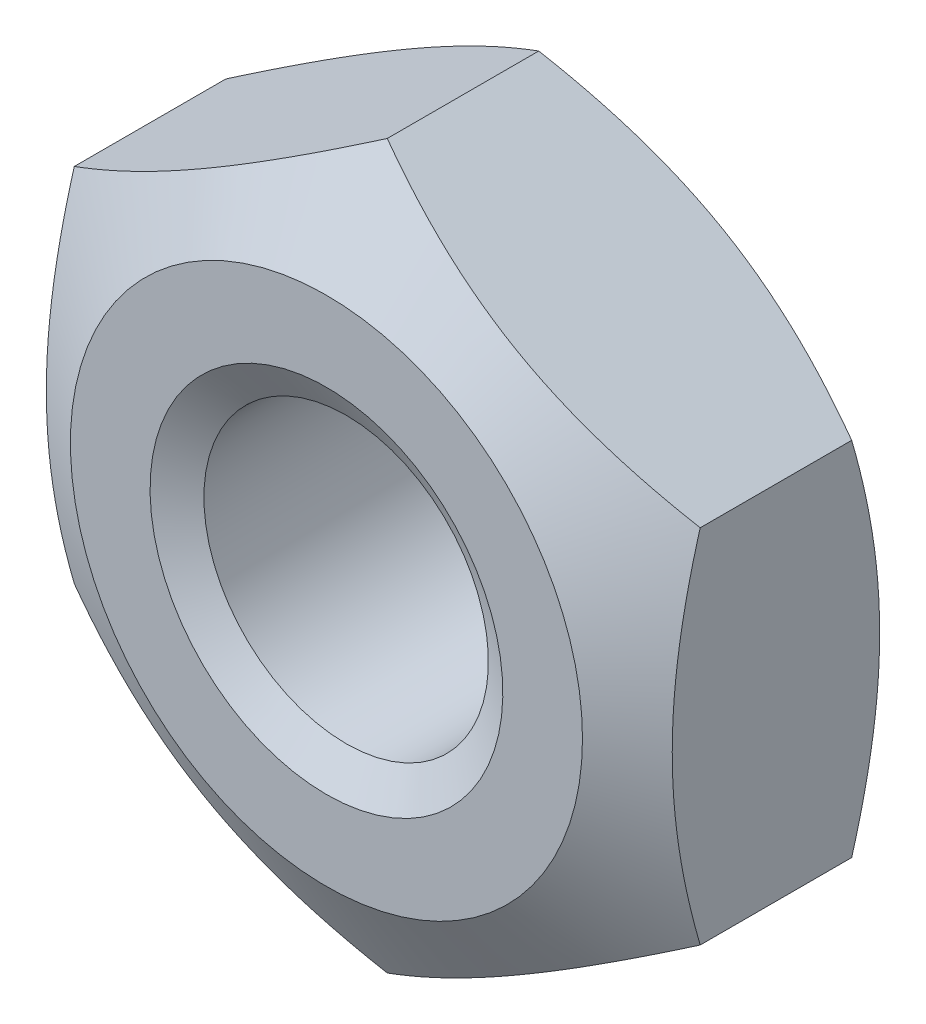
ISO-10303-21;
HEADER;
FILE_DESCRIPTION(('STEP AP214'),'2;1');
FILE_NAME('part.step','',(''),(''),'','','');
FILE_SCHEMA(('AUTOMOTIVE_DESIGN { 1 0 10303 214 1 1 1 1 }'));
ENDSEC;
DATA;
#1=APPLICATION_CONTEXT('core data for automotive mechanical design processes');
#2=APPLICATION_PROTOCOL_DEFINITION('international standard','automotive_design',2000,#1);
#3=PRODUCT_CONTEXT('',#1,'mechanical');
#4=PRODUCT('Part','Part','',(#3));
#5=PRODUCT_RELATED_PRODUCT_CATEGORY('part','',(#4));
#6=PRODUCT_DEFINITION_FORMATION('','',#4);
#7=PRODUCT_DEFINITION_CONTEXT('part definition',#1,'design');
#8=PRODUCT_DEFINITION('design','',#6,#7);
#9=PRODUCT_DEFINITION_SHAPE('','',#8);
#10=(LENGTH_UNIT() NAMED_UNIT(*) SI_UNIT(.MILLI.,.METRE.));
#11=(NAMED_UNIT(*) PLANE_ANGLE_UNIT() SI_UNIT($,.RADIAN.));
#12=(NAMED_UNIT(*) SI_UNIT($,.STERADIAN.) SOLID_ANGLE_UNIT());
#13=UNCERTAINTY_MEASURE_WITH_UNIT(LENGTH_MEASURE(1.E-05),#10,'distance_accuracy_value','');
#14=(GEOMETRIC_REPRESENTATION_CONTEXT(3) GLOBAL_UNCERTAINTY_ASSIGNED_CONTEXT((#13)) GLOBAL_UNIT_ASSIGNED_CONTEXT((#10,
#11,#12)) REPRESENTATION_CONTEXT('',''));
#15=CARTESIAN_POINT('',(0.,0.,0.));
#16=DIRECTION('',(0.,0.,1.));
#17=DIRECTION('',(1.,0.,0.));
#18=AXIS2_PLACEMENT_3D('',#15,#16,#17);
#19=CARTESIAN_POINT('',(0.,0.,0.));
#20=DIRECTION('',(0.,0.,1.));
#21=DIRECTION('',(1.,0.,0.));
#22=AXIS2_PLACEMENT_3D('',#19,#20,#21);
#23=PLANE('',#22);
#24=CARTESIAN_POINT('',(0.,0.,0.));
#25=DIRECTION('',(0.,0.,1.));
#26=DIRECTION('',(0.,-1.,0.));
#27=AXIS2_PLACEMENT_3D('',#24,#25,#26);
#28=CIRCLE('',#27,1.55);
#29=CARTESIAN_POINT('',(0.,-1.54999999999999,0.));
#30=VERTEX_POINT('',#29);
#31=EDGE_CURVE('E269',#30,#30,#28,.T.);
#32=ORIENTED_EDGE('',*,*,#31,.F.);
#33=EDGE_LOOP('',(#32));
#34=FACE_BOUND('',#33,.T.);
#35=CARTESIAN_POINT('',(0.,0.,0.));
#36=DIRECTION('',(0.,0.,1.));
#37=DIRECTION('',(1.,0.,0.));
#38=AXIS2_PLACEMENT_3D('',#35,#36,#37);
#39=CIRCLE('',#38,2.25);
#40=CARTESIAN_POINT('',(2.25,0.,0.));
#41=VERTEX_POINT('',#40);
#42=EDGE_CURVE('E228',#41,#41,#39,.T.);
#43=ORIENTED_EDGE('',*,*,#42,.T.);
#44=EDGE_LOOP('',(#43));
#45=FACE_BOUND('',#44,.T.);
#46=ADVANCED_FACE('F41',(#34,#45),#23,.T.);
#47=CARTESIAN_POINT('',(0.,0.,0.));
#48=DIRECTION('',(0.,0.,-1.));
#49=DIRECTION('',(-1.,0.,0.));
#50=AXIS2_PLACEMENT_3D('',#47,#48,#49);
#51=CONICAL_SURFACE('',#50,2.25,1.0471975511966);
#52=CARTESIAN_POINT('',(-2.75020000000001,1.58759777021761,-0.534361897959571));
#53=CARTESIAN_POINT('',(-2.6293507793401,1.65737010029696,-0.494062796844074));
#54=CARTESIAN_POINT('',(-2.50745839737738,1.72774469983531,-0.457412037192472));
#55=CARTESIAN_POINT('',(-2.26156287327212,1.86971254687,-0.39343731756461));
#56=CARTESIAN_POINT('',(-2.13755536142616,1.94130831721581,-0.366135990269306));
#57=CARTESIAN_POINT('',(-1.89107720202407,2.08361254889597,-0.323636879888924));
#58=CARTESIAN_POINT('',(-1.7686444814126,2.15429911309862,-0.308156253217264));
#59=CARTESIAN_POINT('',(-1.5232028576311,2.29600490065921,-0.289674531964746));
#60=CARTESIAN_POINT('',(-1.4001948467671,2.36702360884402,-0.286658134057405));
#61=CARTESIAN_POINT('',(-1.17034121338922,2.49972966594895,-0.292928280023351));
#62=CARTESIAN_POINT('',(-1.06346120874599,2.56143686540071,-0.300675288871507));
#63=CARTESIAN_POINT('',(-0.85039753266526,2.68444923614045,-0.325230315659159));
#64=CARTESIAN_POINT('',(-0.744214598351119,2.74575398185006,-0.342046724245375));
#65=CARTESIAN_POINT('',(-0.530711510606822,2.86902004703205,-0.384087056940762));
#66=CARTESIAN_POINT('',(-0.42341838385715,2.93096576264317,-0.409489215282037));
#67=CARTESIAN_POINT('',(-0.210432520715951,3.05393320806133,-0.467142360434789));
#68=CARTESIAN_POINT('',(-0.104737054973348,3.11495651365994,-0.49937979789379));
#69=CARTESIAN_POINT('',(0.000199999999999974,3.17554195059677,-0.534361897959569));
#70=B_SPLINE_CURVE_WITH_KNOTS('',3,(#52,#53,#54,#55,#56,#57,#58,#59,#60,#61,#62,#63,#64,#65,#66,
#67,#68,#69),.UNSPECIFIED.,.F.,.F.,(4,2,2,2,2,2,2,2,4),(0.,0.435912828725888,0.872873557116332,
1.29901931904671,1.72464171213573,2.09526089052938,2.46622354066375,2.84541551798559,
3.22386274754526),.UNSPECIFIED.);
#71=CARTESIAN_POINT('',(-2.75,1.58771324027145,-0.534295227656671));
#72=VERTEX_POINT('',#71);
#73=CARTESIAN_POINT('',(0.,3.17542648054293,-0.534295227656671));
#74=VERTEX_POINT('',#73);
#75=EDGE_CURVE('E223',#72,#74,#70,.T.);
#76=ORIENTED_EDGE('',*,*,#75,.F.);
#77=CARTESIAN_POINT('',(-2.74999999999998,-4.17094191172018,-1.58535995000983));
#78=CARTESIAN_POINT('',(-2.74999999999998,-4.05157417919455,-1.52783985485414));
#79=CARTESIAN_POINT('',(-2.74999999999999,-3.93192208680263,-1.47089921340537));
#80=CARTESIAN_POINT('',(-2.74999999999999,-3.69189754974667,-1.35850483223983));
#81=CARTESIAN_POINT('',(-2.74999999999999,-3.57152498585856,-1.30305134743429));
#82=CARTESIAN_POINT('',(-2.74999999999999,-3.3292414178549,-1.19365987345141));
#83=CARTESIAN_POINT('',(-2.74999999999999,-3.20732553286572,-1.1397326551652));
#84=CARTESIAN_POINT('',(-2.74999999999999,-2.96249043886675,-1.03421478265883));
#85=CARTESIAN_POINT('',(-2.74999999999999,-2.83957128062765,-0.982624011057358));
#86=CARTESIAN_POINT('',(-2.74999999999999,-2.58897064424779,-0.880953460848801));
#87=CARTESIAN_POINT('',(-2.74999999999999,-2.46125395597333,-0.830959972131938));
#88=CARTESIAN_POINT('',(-2.74999999999999,-2.20429217508488,-0.734989140643749));
#89=CARTESIAN_POINT('',(-2.74999999999999,-2.0750469081031,-0.689012261170476));
#90=CARTESIAN_POINT('',(-2.74999999999999,-1.81509622614656,-0.602350799198662));
#91=CARTESIAN_POINT('',(-2.75,-1.68439471248182,-0.561654637381358));
#92=CARTESIAN_POINT('',(-2.75,-1.42112044045795,-0.486921696520409));
#93=CARTESIAN_POINT('',(-2.75,-1.28854831568341,-0.452882718076814));
#94=CARTESIAN_POINT('',(-2.75,-1.02216222796121,-0.393330190707876));
#95=CARTESIAN_POINT('',(-2.75,-0.888357777462689,-0.367774900827353));
#96=CARTESIAN_POINT('',(-2.75,-0.619188443271271,-0.326700866431593));
#97=CARTESIAN_POINT('',(-2.75,-0.483823678897038,-0.311181359585503));
#98=CARTESIAN_POINT('',(-2.75,-0.213936143558709,-0.291620721702803));
#99=CARTESIAN_POINT('',(-2.75,-0.0794237789789004,-0.287439497799149));
#100=CARTESIAN_POINT('',(-2.75,0.189476875095198,-0.290546406339069));
#101=CARTESIAN_POINT('',(-2.75,0.323865159350496,-0.297835002730547));
#102=CARTESIAN_POINT('',(-2.75,0.554893379449256,-0.319724470777096));
#103=CARTESIAN_POINT('',(-2.75000000000001,0.651787779258228,-0.331774817011496));
#104=CARTESIAN_POINT('',(-2.75000000000001,0.844801886898879,-0.361034396057224));
#105=CARTESIAN_POINT('',(-2.75000000000001,0.940921474752412,-0.37824441265319));
#106=CARTESIAN_POINT('',(-2.75000000000001,1.22801374432727,-0.436704923279867));
#107=CARTESIAN_POINT('',(-2.75000000000001,1.41759987178668,-0.484773071382858));
#108=CARTESIAN_POINT('',(-2.75000000000001,1.79688918277039,-0.595144853922151));
#109=CARTESIAN_POINT('',(-2.75000000000001,1.98650596068932,-0.65773427101591));
#110=CARTESIAN_POINT('',(-2.75000000000001,2.26832259438815,-0.758664209554614));
#111=CARTESIAN_POINT('',(-2.75000000000001,2.36181446832384,-0.793476731430835));
#112=CARTESIAN_POINT('',(-2.75000000000001,2.54803932294426,-0.865075780032284));
#113=CARTESIAN_POINT('',(-2.75000000000001,2.6407723109558,-0.901862287673288));
#114=CARTESIAN_POINT('',(-2.75000000000002,2.85279068758439,-0.988151634401225));
#115=CARTESIAN_POINT('',(-2.75000000000002,2.97185009604171,-1.03820800297955));
#116=CARTESIAN_POINT('',(-2.75000000000002,3.20902736987715,-1.14050851197707));
#117=CARTESIAN_POINT('',(-2.75000000000002,3.32714519214704,-1.19275275188562));
#118=CARTESIAN_POINT('',(-2.75000000000002,3.68035595861855,-1.35211254525139));
#119=CARTESIAN_POINT('',(-2.75000000000002,3.9142692376034,-1.46183979317702));
#120=CARTESIAN_POINT('',(-2.75000000000002,4.38006837711245,-1.68598214563198));
#121=CARTESIAN_POINT('',(-2.75000000000002,4.61195228635671,-1.80040126470261));
#122=CARTESIAN_POINT('',(-2.75000000000002,5.07411991279684,-2.03243730193511));
#123=CARTESIAN_POINT('',(-2.75000000000003,5.30440357913535,-2.15005432115122));
#124=CARTESIAN_POINT('',(-2.75000000000003,5.74575965877126,-2.37825325657572));
#125=CARTESIAN_POINT('',(-2.75000000000003,5.9569214419775,-2.48866288043221));
#126=CARTESIAN_POINT('',(-2.75000000000003,6.37847605090656,-2.71095354359167));
#127=CARTESIAN_POINT('',(-2.75000000000003,6.5888688543058,-2.82283462518444));
#128=CARTESIAN_POINT('',(-2.75000000000003,7.00860016719332,-3.04748460058433));
#129=CARTESIAN_POINT('',(-2.75000000000003,7.21793996928446,-3.16025108273532));
#130=CARTESIAN_POINT('',(-2.75000000000004,7.63612432069422,-3.38667545638205));
#131=CARTESIAN_POINT('',(-2.75000000000004,7.84496889300508,-3.50033330539519));
#132=CARTESIAN_POINT('',(-2.75000000000004,8.05362923922143,-3.61432611594186));
#133=B_SPLINE_CURVE_WITH_KNOTS('',3,(#77,#78,#79,#80,#81,#82,#83,#84,#85,#86,#87,#88,#89,#90,
#91,#92,#93,#94,#95,#96,#97,#98,#99,#100,#101,#102,#103,#104,#105,#106,#107,#108,#109,#110,#111,
#112,#113,#114,#115,#116,#117,#118,#119,#120,#121,#122,#123,#124,#125,#126,#127,#128,#129,#130,
#131,#132),.UNSPECIFIED.,.F.,.F.,(4,2,2,2,2,2,2,2,2,2,2,2,2,2,2,2,2,2,2,2,2,2,2,2,2,2,2,4),(0.,
0.397516289629709,0.795100286958886,1.19501152551803,1.59490265050159,2.00630901998287,
2.41776278088078,2.8282985036957,3.23869836376216,3.64704799033318,4.05536659450197,
4.45861662670271,4.86188297056404,5.15466277742565,5.44748708183662,6.03349625442335,
6.63219807054858,6.93146946485046,7.23073796635865,7.61817202589461,8.00562372244204,
8.78064716960591,9.55634818940369,10.3320737500517,11.0469209777075,11.7617887952143,
12.4751271265047,13.1884316641826),.UNSPECIFIED.);
#134=CARTESIAN_POINT('',(-2.75,-1.58771324027146,-0.534295227656671));
#135=VERTEX_POINT('',#134);
#136=EDGE_CURVE('E191',#135,#72,#133,.T.);
#137=ORIENTED_EDGE('',*,*,#136,.F.);
#138=CARTESIAN_POINT('',(0.000200000000020716,-3.17554195059679,-0.534361897959577));
#139=CARTESIAN_POINT('',(-0.120649220659886,-3.10576962051743,-0.49406279684408));
#140=CARTESIAN_POINT('',(-0.242541602622614,-3.03539502097909,-0.457412037192478));
#141=CARTESIAN_POINT('',(-0.488437126727875,-2.89342717394439,-0.393437317564616));
#142=CARTESIAN_POINT('',(-0.612444638573838,-2.82183140359859,-0.366135990269313));
#143=CARTESIAN_POINT('',(-0.858922797975928,-2.67952717191843,-0.323636879888932));
#144=CARTESIAN_POINT('',(-0.981355518587402,-2.60884060771578,-0.308156253217272));
#145=CARTESIAN_POINT('',(-1.2267971423689,-2.4671348201552,-0.289674531964755));
#146=CARTESIAN_POINT('',(-1.3498051532329,-2.39611611197039,-0.286658134057414));
#147=CARTESIAN_POINT('',(-1.57965878661078,-2.26341005486546,-0.292928280023361));
#148=CARTESIAN_POINT('',(-1.68653879125401,-2.2017028554137,-0.300675288871517));
#149=CARTESIAN_POINT('',(-1.89960246733474,-2.07869048467396,-0.325230315659169));
#150=CARTESIAN_POINT('',(-2.00578540164888,-2.01738573896435,-0.342046724245385));
#151=CARTESIAN_POINT('',(-2.21928848939318,-1.89411967378236,-0.384087056940771));
#152=CARTESIAN_POINT('',(-2.32658161614285,-1.83217395817124,-0.409489215282046));
#153=CARTESIAN_POINT('',(-2.53956747928405,-1.70920651275309,-0.467142360434797));
#154=CARTESIAN_POINT('',(-2.64526294502665,-1.64818320715448,-0.499379797893798));
#155=CARTESIAN_POINT('',(-2.7502,-1.58759777021765,-0.534361897959576));
#156=B_SPLINE_CURVE_WITH_KNOTS('',3,(#138,#139,#140,#141,#142,#143,#144,#145,#146,#147,#148,
#149,#150,#151,#152,#153,#154,#155),.UNSPECIFIED.,.F.,.F.,(4,2,2,2,2,2,2,2,4),(0.,
0.43591282872589,0.872873557116335,1.29901931904672,1.72464171213574,2.09526089052938,
2.46622354066375,2.84541551798558,3.22386274754525),.UNSPECIFIED.);
#157=CARTESIAN_POINT('',(0.,-3.17542648054293,-0.534295227656671));
#158=VERTEX_POINT('',#157);
#159=EDGE_CURVE('E183',#158,#135,#156,.T.);
#160=ORIENTED_EDGE('',*,*,#159,.F.);
#161=CARTESIAN_POINT('',(2.7502,-1.58759777021763,-0.53436189795957));
#162=CARTESIAN_POINT('',(2.62935077934009,-1.65737010029698,-0.494062796844073));
#163=CARTESIAN_POINT('',(2.50745839737736,-1.72774469983533,-0.457412037192472));
#164=CARTESIAN_POINT('',(2.2615628732721,-1.86971254687003,-0.393437317564612));
#165=CARTESIAN_POINT('',(2.13755536142614,-1.94130831721583,-0.366135990269309));
#166=CARTESIAN_POINT('',(1.89107720202405,-2.08361254889599,-0.323636879888929));
#167=CARTESIAN_POINT('',(1.76864448141258,-2.15429911309864,-0.308156253217271));
#168=CARTESIAN_POINT('',(1.52320285763108,-2.29600490065923,-0.289674531964754));
#169=CARTESIAN_POINT('',(1.40019484676709,-2.36702360884404,-0.286658134057414));
#170=CARTESIAN_POINT('',(1.17034121338921,-2.49972966594898,-0.292928280023363));
#171=CARTESIAN_POINT('',(1.06346120874598,-2.56143686540073,-0.300675288871519));
#172=CARTESIAN_POINT('',(0.850397532665258,-2.68444923614047,-0.325230315659172));
#173=CARTESIAN_POINT('',(0.74421459835112,-2.74575398185008,-0.342046724245387));
#174=CARTESIAN_POINT('',(0.530711510606829,-2.86902004703207,-0.384087056940773));
#175=CARTESIAN_POINT('',(0.423418383857159,-2.93096576264319,-0.409489215282048));
#176=CARTESIAN_POINT('',(0.210432520715966,-3.05393320806134,-0.467142360434799));
#177=CARTESIAN_POINT('',(0.104737054973367,-3.11495651365996,-0.499379797893799));
#178=CARTESIAN_POINT('',(-0.000199999999979356,-3.17554195059679,-0.534361897959577));
#179=B_SPLINE_CURVE_WITH_KNOTS('',3,(#161,#162,#163,#164,#165,#166,#167,#168,#169,#170,#171,
#172,#173,#174,#175,#176,#177,#178),.UNSPECIFIED.,.F.,.F.,(4,2,2,2,2,2,2,2,4),(0.,
0.435912828725888,0.872873557116332,1.29901931904672,1.72464171213574,2.09526089052937,
2.46622354066373,2.84541551798556,3.22386274754523),.UNSPECIFIED.);
#180=CARTESIAN_POINT('',(2.74999999999999,-1.58771324027147,-0.534295227656671));
#181=VERTEX_POINT('',#180);
#182=EDGE_CURVE('E99',#181,#158,#179,.T.);
#183=ORIENTED_EDGE('',*,*,#182,.F.);
#184=CARTESIAN_POINT('',(2.75,-4.17094191172015,-1.58535995000982));
#185=CARTESIAN_POINT('',(2.75,-4.05157417919452,-1.52783985485413));
#186=CARTESIAN_POINT('',(2.75,-3.9319220868026,-1.47089921340535));
#187=CARTESIAN_POINT('',(2.75,-3.69189754974664,-1.35850483223982));
#188=CARTESIAN_POINT('',(2.75,-3.57152498585853,-1.30305134743428));
#189=CARTESIAN_POINT('',(2.75,-3.32924141785487,-1.1936598734514));
#190=CARTESIAN_POINT('',(2.75,-3.20732553286569,-1.13973265516519));
#191=CARTESIAN_POINT('',(2.75,-2.96249043886672,-1.03421478265882));
#192=CARTESIAN_POINT('',(2.75,-2.83957128062762,-0.982624011057348));
#193=CARTESIAN_POINT('',(2.75,-2.58897064424776,-0.880953460848792));
#194=CARTESIAN_POINT('',(2.75,-2.4612539559733,-0.830959972131929));
#195=CARTESIAN_POINT('',(2.75,-2.20429217508485,-0.734989140643741));
#196=CARTESIAN_POINT('',(2.75,-2.07504690810308,-0.689012261170468));
#197=CARTESIAN_POINT('',(2.75,-1.81509622614653,-0.602350799198655));
#198=CARTESIAN_POINT('',(2.75,-1.6843947124818,-0.56165463738135));
#199=CARTESIAN_POINT('',(2.75,-1.42112044045793,-0.486921696520402));
#200=CARTESIAN_POINT('',(2.75,-1.28854831568339,-0.452882718076808));
#201=CARTESIAN_POINT('',(2.75,-1.02216222796119,-0.393330190707871));
#202=CARTESIAN_POINT('',(2.75,-0.888357777462668,-0.367774900827347));
#203=CARTESIAN_POINT('',(2.75,-0.619188443271251,-0.326700866431588));
#204=CARTESIAN_POINT('',(2.75,-0.483823678897018,-0.311181359585498));
#205=CARTESIAN_POINT('',(2.75,-0.213936143558689,-0.291620721702799));
#206=CARTESIAN_POINT('',(2.75,-0.0794237789788813,-0.287439497799145));
#207=CARTESIAN_POINT('',(2.75,0.189476875095217,-0.290546406339066));
#208=CARTESIAN_POINT('',(2.75,0.323865159350514,-0.297835002730543));
#209=CARTESIAN_POINT('',(2.75,0.554893379449273,-0.319724470777093));
#210=CARTESIAN_POINT('',(2.75,0.651787779258245,-0.331774817011493));
#211=CARTESIAN_POINT('',(2.75,0.844801886898896,-0.361034396057221));
#212=CARTESIAN_POINT('',(2.75,0.940921474752429,-0.378244412653187));
#213=CARTESIAN_POINT('',(2.75,1.22801374432728,-0.436704923279864));
#214=CARTESIAN_POINT('',(2.75,1.4175998717867,-0.484773071382855));
#215=CARTESIAN_POINT('',(2.75,1.79688918277041,-0.595144853922149));
#216=CARTESIAN_POINT('',(2.75,1.98650596068934,-0.657734271015908));
#217=CARTESIAN_POINT('',(2.75,2.26832259438817,-0.758664209554612));
#218=CARTESIAN_POINT('',(2.75,2.36181446832386,-0.793476731430834));
#219=CARTESIAN_POINT('',(2.75,2.54803932294428,-0.865075780032283));
#220=CARTESIAN_POINT('',(2.75,2.64077231095581,-0.901862287673287));
#221=CARTESIAN_POINT('',(2.75,2.85279068758441,-0.988151634401225));
#222=CARTESIAN_POINT('',(2.75,2.97185009604173,-1.03820800297955));
#223=CARTESIAN_POINT('',(2.75,3.20902736987717,-1.14050851197707));
#224=CARTESIAN_POINT('',(2.75,3.32714519214706,-1.19275275188562));
#225=CARTESIAN_POINT('',(2.75,3.68035595861857,-1.35211254525139));
#226=CARTESIAN_POINT('',(2.75,3.91426923760343,-1.46183979317702));
#227=CARTESIAN_POINT('',(2.75,4.38006837711248,-1.68598214563198));
#228=CARTESIAN_POINT('',(2.75,4.61195228635674,-1.80040126470262));
#229=CARTESIAN_POINT('',(2.75,5.07411991279688,-2.03243730193512));
#230=CARTESIAN_POINT('',(2.75,5.30440357913539,-2.15005432115123));
#231=CARTESIAN_POINT('',(2.75,5.7457596587713,-2.37825325657574));
#232=CARTESIAN_POINT('',(2.75,5.95692144197755,-2.48866288043222));
#233=CARTESIAN_POINT('',(2.75,6.37847605090661,-2.71095354359168));
#234=CARTESIAN_POINT('',(2.75,6.58886885430584,-2.82283462518446));
#235=CARTESIAN_POINT('',(2.75,7.00860016719337,-3.04748460058435));
#236=CARTESIAN_POINT('',(2.75,7.21793996928451,-3.16025108273533));
#237=CARTESIAN_POINT('',(2.75,7.63612432069427,-3.38667545638207));
#238=CARTESIAN_POINT('',(2.75,7.84496889300514,-3.50033330539521));
#239=CARTESIAN_POINT('',(2.75,8.05362923922149,-3.61432611594188));
#240=B_SPLINE_CURVE_WITH_KNOTS('',3,(#184,#185,#186,#187,#188,#189,#190,#191,#192,#193,#194,
#195,#196,#197,#198,#199,#200,#201,#202,#203,#204,#205,#206,#207,#208,#209,#210,#211,#212,#213,
#214,#215,#216,#217,#218,#219,#220,#221,#222,#223,#224,#225,#226,#227,#228,#229,#230,#231,#232,
#233,#234,#235,#236,#237,#238,#239),.UNSPECIFIED.,.F.,.F.,(4,2,2,2,2,2,2,2,2,2,2,2,2,2,2,2,2,2,
2,2,2,2,2,2,2,2,2,4),(0.,0.397516289629708,0.795100286958884,1.19501152551802,1.59490265050159,
2.00630901998287,2.41776278088077,2.82829850369569,3.23869836376215,3.64704799033317,
4.05536659450196,4.4586166267027,4.86188297056402,5.15466277742563,5.4474870818366,
6.03349625442333,6.63219807054856,6.93146946485044,7.23073796635863,7.6181720258946,
8.00562372244203,8.78064716960591,9.55634818940369,10.3320737500517,11.0469209777075,
11.7617887952143,12.4751271265048,13.1884316641826),.UNSPECIFIED.);
#241=CARTESIAN_POINT('',(2.75,1.58771324027146,-0.534295227656671));
#242=VERTEX_POINT('',#241);
#243=EDGE_CURVE('E95',#242,#181,#240,.F.);
#244=ORIENTED_EDGE('',*,*,#243,.F.);
#245=CARTESIAN_POINT('',(-0.0002,3.17554195059677,-0.534361897959569));
#246=CARTESIAN_POINT('',(0.120649220659906,3.10576962051742,-0.494062796844072));
#247=CARTESIAN_POINT('',(0.242541602622634,3.03539502097908,-0.457412037192472));
#248=CARTESIAN_POINT('',(0.488437126727894,2.89342717394438,-0.393437317564611));
#249=CARTESIAN_POINT('',(0.612444638573858,2.82183140359858,-0.366135990269308));
#250=CARTESIAN_POINT('',(0.858922797975947,2.67952717191842,-0.323636879888929));
#251=CARTESIAN_POINT('',(0.981355518587421,2.60884060771577,-0.308156253217271));
#252=CARTESIAN_POINT('',(1.22679714236892,2.46713482015519,-0.289674531964755));
#253=CARTESIAN_POINT('',(1.34980515323292,2.39611611197038,-0.286658134057415));
#254=CARTESIAN_POINT('',(1.5796587866108,2.26341005486545,-0.292928280023363));
#255=CARTESIAN_POINT('',(1.68653879125403,2.20170285541369,-0.300675288871519));
#256=CARTESIAN_POINT('',(1.89960246733475,2.07869048467396,-0.325230315659172));
#257=CARTESIAN_POINT('',(2.00578540164889,2.01738573896435,-0.342046724245388));
#258=CARTESIAN_POINT('',(2.21928848939318,1.89411967378237,-0.384087056940775));
#259=CARTESIAN_POINT('',(2.32658161614285,1.83217395817125,-0.409489215282049));
#260=CARTESIAN_POINT('',(2.53956747928405,1.7092065127531,-0.4671423604348));
#261=CARTESIAN_POINT('',(2.64526294502665,1.64818320715448,-0.4993797978938));
#262=CARTESIAN_POINT('',(2.7502,1.58759777021766,-0.534361897959578));
#263=B_SPLINE_CURVE_WITH_KNOTS('',3,(#245,#246,#247,#248,#249,#250,#251,#252,#253,#254,#255,
#256,#257,#258,#259,#260,#261,#262),.UNSPECIFIED.,.F.,.F.,(4,2,2,2,2,2,2,2,4),(0.,
0.435912828725888,0.872873557116331,1.29901931904671,1.72464171213573,2.09526089052937,
2.46622354066373,2.84541551798556,3.22386274754522),.UNSPECIFIED.);
#264=EDGE_CURVE('E67',#74,#242,#263,.T.);
#265=ORIENTED_EDGE('',*,*,#264,.F.);
#266=EDGE_LOOP('',(#76,#137,#160,#183,#244,#265));
#267=FACE_BOUND('',#266,.T.);
#268=ORIENTED_EDGE('',*,*,#42,.F.);
#269=EDGE_LOOP('',(#268));
#270=FACE_BOUND('',#269,.T.);
#271=ADVANCED_FACE('F96',(#267,#270),#51,.T.);
#272=CARTESIAN_POINT('',(2.75,1.58771324027149,-2.4));
#273=DIRECTION('',(0.499999999999993,0.866025403784443,0.));
#274=DIRECTION('',(-0.866025403784443,0.499999999999993,0.));
#275=AXIS2_PLACEMENT_3D('',#272,#273,#274);
#276=PLANE('',#275);
#277=DIRECTION('',(0.,0.,1.));
#278=VECTOR('',#277,1.);
#279=CARTESIAN_POINT('',(2.75,1.58771324027149,-2.4));
#280=LINE('',#279,#278);
#281=CARTESIAN_POINT('',(2.75,1.58771324027146,-1.86570477234333));
#282=VERTEX_POINT('',#281);
#283=EDGE_CURVE('E11',#282,#242,#280,.T.);
#284=ORIENTED_EDGE('',*,*,#283,.F.);
#285=CARTESIAN_POINT('',(2.7502,1.58759777021766,-1.86563810204042));
#286=CARTESIAN_POINT('',(2.62935077934009,1.65737010029701,-1.90593720315592));
#287=CARTESIAN_POINT('',(2.50745839737736,1.72774469983535,-1.94258796280752));
#288=CARTESIAN_POINT('',(2.2615628732721,1.86971254687005,-2.00656268243538));
#289=CARTESIAN_POINT('',(2.13755536142614,1.94130831721585,-2.03386400973069));
#290=CARTESIAN_POINT('',(1.89107720202405,2.08361254889601,-2.07636312011107));
#291=CARTESIAN_POINT('',(1.76864448141257,2.15429911309866,-2.09184374678273));
#292=CARTESIAN_POINT('',(1.52320285763107,2.29600490065924,-2.11032546803524));
#293=CARTESIAN_POINT('',(1.40019484676707,2.36702360884405,-2.11334186594259));
#294=CARTESIAN_POINT('',(1.17034121338919,2.49972966594898,-2.10707171997664));
#295=CARTESIAN_POINT('',(1.06346120874597,2.56143686540074,-2.09932471112848));
#296=CARTESIAN_POINT('',(0.85039753266524,2.68444923614047,-2.07476968434083));
#297=CARTESIAN_POINT('',(0.744214598351102,2.74575398185008,-2.05795327575462));
#298=CARTESIAN_POINT('',(0.53071151060681,2.86902004703206,-2.01591294305923));
#299=CARTESIAN_POINT('',(0.42341838385714,2.93096576264318,-1.99051078471796));
#300=CARTESIAN_POINT('',(0.210432520715947,3.05393320806133,-1.93285763956521));
#301=CARTESIAN_POINT('',(0.104737054973347,3.11495651365995,-1.90062020210621));
#302=CARTESIAN_POINT('',(-0.000199999999999647,3.17554195059677,-1.86563810204043));
#303=B_SPLINE_CURVE_WITH_KNOTS('',3,(#285,#286,#287,#288,#289,#290,#291,#292,#293,#294,#295,
#296,#297,#298,#299,#300,#301,#302),.UNSPECIFIED.,.F.,.F.,(4,2,2,2,2,2,2,2,4),(0.,
0.435912828725889,0.872873557116334,1.29901931904672,1.72464171213574,2.09526089052937,
2.46622354066374,2.84541551798556,3.22386274754522),.UNSPECIFIED.);
#304=CARTESIAN_POINT('',(0.,3.17542648054293,-1.86570477234333));
#305=VERTEX_POINT('',#304);
#306=EDGE_CURVE('E115',#282,#305,#303,.T.);
#307=ORIENTED_EDGE('',*,*,#306,.T.);
#308=DIRECTION('',(0.,0.,1.));
#309=VECTOR('',#308,1.);
#310=CARTESIAN_POINT('',(0.,3.17542648054293,-2.4));
#311=LINE('',#310,#309);
#312=EDGE_CURVE('E46',#305,#74,#311,.T.);
#313=ORIENTED_EDGE('',*,*,#312,.T.);
#314=ORIENTED_EDGE('',*,*,#264,.T.);
#315=EDGE_LOOP('',(#284,#307,#313,#314));
#316=FACE_BOUND('',#315,.T.);
#317=ADVANCED_FACE('F43',(#316),#276,.T.);
#318=CARTESIAN_POINT('',(2.75,-1.58771324027147,-2.4));
#319=DIRECTION('',(1.,0.,0.));
#320=DIRECTION('',(0.,0.,-1.));
#321=AXIS2_PLACEMENT_3D('',#318,#319,#320);
#322=PLANE('',#321);
#323=DIRECTION('',(0.,0.,1.));
#324=VECTOR('',#323,1.);
#325=CARTESIAN_POINT('',(2.75,-1.58771324027147,-2.4));
#326=LINE('',#325,#324);
#327=CARTESIAN_POINT('',(2.74999999999999,-1.58771324027147,-1.86570477234333));
#328=VERTEX_POINT('',#327);
#329=EDGE_CURVE('E51',#328,#181,#326,.T.);
#330=ORIENTED_EDGE('',*,*,#329,.F.);
#331=CARTESIAN_POINT('',(2.75,-4.17094191172015,-0.814640049990189));
#332=CARTESIAN_POINT('',(2.75,-4.05157417919452,-0.872160145145874));
#333=CARTESIAN_POINT('',(2.75,-3.9319220868026,-0.929100786594652));
#334=CARTESIAN_POINT('',(2.75,-3.69189754974664,-1.04149516776018));
#335=CARTESIAN_POINT('',(2.75,-3.57152498585853,-1.09694865256572));
#336=CARTESIAN_POINT('',(2.75,-3.32924141785487,-1.2063401265486));
#337=CARTESIAN_POINT('',(2.75,-3.20732553286569,-1.26026734483481));
#338=CARTESIAN_POINT('',(2.75,-2.96249043886672,-1.36578521734119));
#339=CARTESIAN_POINT('',(2.75,-2.83957128062762,-1.41737598894266));
#340=CARTESIAN_POINT('',(2.75,-2.58897064424776,-1.51904653915121));
#341=CARTESIAN_POINT('',(2.75,-2.4612539559733,-1.56904002786807));
#342=CARTESIAN_POINT('',(2.75,-2.20429217508485,-1.66501085935626));
#343=CARTESIAN_POINT('',(2.75,-2.07504690810308,-1.71098773882953));
#344=CARTESIAN_POINT('',(2.75,-1.81509622614653,-1.79764920080135));
#345=CARTESIAN_POINT('',(2.75,-1.6843947124818,-1.83834536261865));
#346=CARTESIAN_POINT('',(2.75,-1.42112044045793,-1.9130783034796));
#347=CARTESIAN_POINT('',(2.75,-1.28854831568339,-1.94711728192319));
#348=CARTESIAN_POINT('',(2.75,-1.02216222796118,-2.00666980929213));
#349=CARTESIAN_POINT('',(2.75,-0.888357777462668,-2.03222509917265));
#350=CARTESIAN_POINT('',(2.75,-0.619188443271251,-2.07329913356841));
#351=CARTESIAN_POINT('',(2.75,-0.483823678897018,-2.0888186404145));
#352=CARTESIAN_POINT('',(2.75,-0.21393614355869,-2.1083792782972));
#353=CARTESIAN_POINT('',(2.75,-0.0794237789788815,-2.11256050220086));
#354=CARTESIAN_POINT('',(2.75,0.189476875095216,-2.10945359366093));
#355=CARTESIAN_POINT('',(2.75,0.323865159350513,-2.10216499726946));
#356=CARTESIAN_POINT('',(2.75,0.554893379449272,-2.08027552922291));
#357=CARTESIAN_POINT('',(2.75,0.651787779258244,-2.06822518298851));
#358=CARTESIAN_POINT('',(2.75,0.844801886898897,-2.03896560394278));
#359=CARTESIAN_POINT('',(2.75,0.94092147475243,-2.02175558734681));
#360=CARTESIAN_POINT('',(2.75,1.22801374432729,-1.96329507672014));
#361=CARTESIAN_POINT('',(2.75,1.41759987178671,-1.91522692861715));
#362=CARTESIAN_POINT('',(2.75,1.79688918277042,-1.80485514607785));
#363=CARTESIAN_POINT('',(2.75,1.98650596068935,-1.74226572898409));
#364=CARTESIAN_POINT('',(2.75,2.26832259438818,-1.64133579044539));
#365=CARTESIAN_POINT('',(2.75,2.36181446832387,-1.60652326856917));
#366=CARTESIAN_POINT('',(2.75,2.54803932294429,-1.53492421996772));
#367=CARTESIAN_POINT('',(2.75,2.64077231095583,-1.49813771232671));
#368=CARTESIAN_POINT('',(2.75,2.85279068758442,-1.41184836559877));
#369=CARTESIAN_POINT('',(2.75,2.97185009604174,-1.36179199702045));
#370=CARTESIAN_POINT('',(2.75,3.20902736987719,-1.25949148802293));
#371=CARTESIAN_POINT('',(2.75,3.32714519214708,-1.20724724811438));
#372=CARTESIAN_POINT('',(2.75,3.68035595861859,-1.04788745474861));
#373=CARTESIAN_POINT('',(2.75,3.91426923760344,-0.938160206822976));
#374=CARTESIAN_POINT('',(2.75,4.38006837711249,-0.714017854368019));
#375=CARTESIAN_POINT('',(2.75,4.61195228635675,-0.599598735297385));
#376=CARTESIAN_POINT('',(2.75,5.07411991279689,-0.36756269806488));
#377=CARTESIAN_POINT('',(2.75,5.3044035791354,-0.249945678848773));
#378=CARTESIAN_POINT('',(2.75,5.74575965877131,-0.0217467434242689));
#379=CARTESIAN_POINT('',(2.75,5.95692144197756,0.0886628804322174));
#380=CARTESIAN_POINT('',(2.75,6.37847605090662,0.310953543591677));
#381=CARTESIAN_POINT('',(2.75,6.58886885430586,0.42283462518445));
#382=CARTESIAN_POINT('',(2.75,7.00860016719338,0.647484600584343));
#383=CARTESIAN_POINT('',(2.75,7.21793996928452,0.760251082735328));
#384=CARTESIAN_POINT('',(2.75,7.63612432069429,0.986675456382062));
#385=CARTESIAN_POINT('',(2.75,7.84496889300515,1.1003333053952));
#386=CARTESIAN_POINT('',(2.75,8.0536292392215,1.21432611594187));
#387=B_SPLINE_CURVE_WITH_KNOTS('',3,(#331,#332,#333,#334,#335,#336,#337,#338,#339,#340,#341,
#342,#343,#344,#345,#346,#347,#348,#349,#350,#351,#352,#353,#354,#355,#356,#357,#358,#359,#360,
#361,#362,#363,#364,#365,#366,#367,#368,#369,#370,#371,#372,#373,#374,#375,#376,#377,#378,#379,
#380,#381,#382,#383,#384,#385,#386),.UNSPECIFIED.,.F.,.F.,(4,2,2,2,2,2,2,2,2,2,2,2,2,2,2,2,2,2,
2,2,2,2,2,2,2,2,2,4),(0.,0.397516289629709,0.795100286958884,1.19501152551802,1.59490265050159,
2.00630901998287,2.41776278088077,2.82829850369569,3.23869836376215,3.64704799033317,
4.05536659450196,4.4586166267027,4.86188297056402,5.15466277742563,5.44748708183661,
6.03349625442334,6.63219807054857,6.93146946485045,7.23073796635864,7.61817202589461,
8.00562372244204,8.78064716960592,9.5563481894037,10.3320737500517,11.0469209777075,
11.7617887952144,12.4751271265048,13.1884316641826),.UNSPECIFIED.);
#388=EDGE_CURVE('E113',#328,#282,#387,.T.);
#389=ORIENTED_EDGE('',*,*,#388,.T.);
#390=ORIENTED_EDGE('',*,*,#283,.T.);
#391=ORIENTED_EDGE('',*,*,#243,.T.);
#392=EDGE_LOOP('',(#330,#389,#390,#391));
#393=FACE_BOUND('',#392,.T.);
#394=ADVANCED_FACE('F112',(#393),#322,.T.);
#395=CARTESIAN_POINT('',(0.,-3.17542648054295,-2.4));
#396=DIRECTION('',(0.500000000000006,-0.866025403784435,0.));
#397=DIRECTION('',(0.866025403784435,0.500000000000006,0.));
#398=AXIS2_PLACEMENT_3D('',#395,#396,#397);
#399=PLANE('',#398);
#400=DIRECTION('',(0.,0.,1.));
#401=VECTOR('',#400,1.);
#402=CARTESIAN_POINT('',(0.,-3.17542648054295,-2.4));
#403=LINE('',#402,#401);
#404=CARTESIAN_POINT('',(0.,-3.17542648054293,-1.86570477234333));
#405=VERTEX_POINT('',#404);
#406=EDGE_CURVE('E212',#405,#158,#403,.T.);
#407=ORIENTED_EDGE('',*,*,#406,.F.);
#408=CARTESIAN_POINT('',(-0.000199999999979462,-3.17554195059679,-1.86563810204042));
#409=CARTESIAN_POINT('',(0.120649220659926,-3.10576962051743,-1.90593720315592));
#410=CARTESIAN_POINT('',(0.242541602622654,-3.03539502097908,-1.94258796280752));
#411=CARTESIAN_POINT('',(0.488437126727912,-2.89342717394439,-2.00656268243538));
#412=CARTESIAN_POINT('',(0.612444638573875,-2.82183140359858,-2.03386400973069));
#413=CARTESIAN_POINT('',(0.858922797975963,-2.67952717191842,-2.07636312011107));
#414=CARTESIAN_POINT('',(0.981355518587436,-2.60884060771577,-2.09184374678273));
#415=CARTESIAN_POINT('',(1.22679714236893,-2.46713482015518,-2.11032546803525));
#416=CARTESIAN_POINT('',(1.34980515323293,-2.39611611197037,-2.11334186594259));
#417=CARTESIAN_POINT('',(1.57965878661081,-2.26341005486544,-2.10707171997664));
#418=CARTESIAN_POINT('',(1.68653879125404,-2.20170285541368,-2.09932471112848));
#419=CARTESIAN_POINT('',(1.89960246733476,-2.07869048467394,-2.07476968434083));
#420=CARTESIAN_POINT('',(2.0057854016489,-2.01738573896433,-2.05795327575462));
#421=CARTESIAN_POINT('',(2.21928848939319,-1.89411967378234,-2.01591294305923));
#422=CARTESIAN_POINT('',(2.32658161614286,-1.83217395817123,-1.99051078471796));
#423=CARTESIAN_POINT('',(2.53956747928405,-1.70920651275307,-1.93285763956521));
#424=CARTESIAN_POINT('',(2.64526294502665,-1.64818320715446,-1.90062020210621));
#425=CARTESIAN_POINT('',(2.7502,-1.58759777021763,-1.86563810204043));
#426=B_SPLINE_CURVE_WITH_KNOTS('',3,(#408,#409,#410,#411,#412,#413,#414,#415,#416,#417,#418,
#419,#420,#421,#422,#423,#424,#425),.UNSPECIFIED.,.F.,.F.,(4,2,2,2,2,2,2,2,4),(0.,
0.435912828725889,0.872873557116334,1.29901931904672,1.72464171213574,2.09526089052937,
2.46622354066374,2.84541551798556,3.22386274754523),.UNSPECIFIED.);
#427=EDGE_CURVE('E116',#405,#328,#426,.T.);
#428=ORIENTED_EDGE('',*,*,#427,.T.);
#429=ORIENTED_EDGE('',*,*,#329,.T.);
#430=ORIENTED_EDGE('',*,*,#182,.T.);
#431=EDGE_LOOP('',(#407,#428,#429,#430));
#432=FACE_BOUND('',#431,.T.);
#433=ADVANCED_FACE('F177',(#432),#399,.T.);
#434=CARTESIAN_POINT('',(-2.75,-1.58771324027149,-2.4));
#435=DIRECTION('',(-0.499999999999995,-0.866025403784441,0.));
#436=DIRECTION('',(0.866025403784441,-0.499999999999995,0.));
#437=AXIS2_PLACEMENT_3D('',#434,#435,#436);
#438=PLANE('',#437);
#439=DIRECTION('',(0.,0.,1.));
#440=VECTOR('',#439,1.);
#441=CARTESIAN_POINT('',(-2.75,-1.58771324027149,-2.4));
#442=LINE('',#441,#440);
#443=CARTESIAN_POINT('',(-2.75,-1.58771324027146,-1.86570477234333));
#444=VERTEX_POINT('',#443);
#445=EDGE_CURVE('E215',#444,#135,#442,.T.);
#446=ORIENTED_EDGE('',*,*,#445,.F.);
#447=CARTESIAN_POINT('',(-2.7502,-1.58759777021765,-1.86563810204043));
#448=CARTESIAN_POINT('',(-2.62935077934009,-1.657370100297,-1.90593720315592));
#449=CARTESIAN_POINT('',(-2.50745839737736,-1.72774469983535,-1.94258796280752));
#450=CARTESIAN_POINT('',(-2.2615628732721,-1.86971254687004,-2.00656268243539));
#451=CARTESIAN_POINT('',(-2.13755536142614,-1.94130831721584,-2.03386400973069));
#452=CARTESIAN_POINT('',(-1.89107720202405,-2.083612548896,-2.07636312011107));
#453=CARTESIAN_POINT('',(-1.76864448141257,-2.15429911309865,-2.09184374678273));
#454=CARTESIAN_POINT('',(-1.52320285763107,-2.29600490065924,-2.11032546803525));
#455=CARTESIAN_POINT('',(-1.40019484676708,-2.36702360884405,-2.11334186594259));
#456=CARTESIAN_POINT('',(-1.17034121338919,-2.49972966594898,-2.10707171997664));
#457=CARTESIAN_POINT('',(-1.06346120874597,-2.56143686540074,-2.09932471112848));
#458=CARTESIAN_POINT('',(-0.850397532665236,-2.68444923614048,-2.07476968434083));
#459=CARTESIAN_POINT('',(-0.744214598351095,-2.74575398185009,-2.05795327575462));
#460=CARTESIAN_POINT('',(-0.530711510606799,-2.86902004703207,-2.01591294305923));
#461=CARTESIAN_POINT('',(-0.423418383857127,-2.93096576264319,-1.99051078471796));
#462=CARTESIAN_POINT('',(-0.210432520715929,-3.05393320806134,-1.9328576395652));
#463=CARTESIAN_POINT('',(-0.104737054973327,-3.11495651365996,-1.9006202021062));
#464=CARTESIAN_POINT('',(0.000200000000020994,-3.17554195059679,-1.86563810204042));
#465=B_SPLINE_CURVE_WITH_KNOTS('',3,(#447,#448,#449,#450,#451,#452,#453,#454,#455,#456,#457,
#458,#459,#460,#461,#462,#463,#464),.UNSPECIFIED.,.F.,.F.,(4,2,2,2,2,2,2,2,4),(0.,
0.435912828725889,0.872873557116334,1.29901931904672,1.72464171213574,2.09526089052938,
2.46622354066375,2.84541551798558,3.22386274754525),.UNSPECIFIED.);
#466=EDGE_CURVE('E119',#444,#405,#465,.T.);
#467=ORIENTED_EDGE('',*,*,#466,.T.);
#468=ORIENTED_EDGE('',*,*,#406,.T.);
#469=ORIENTED_EDGE('',*,*,#159,.T.);
#470=EDGE_LOOP('',(#446,#467,#468,#469));
#471=FACE_BOUND('',#470,.T.);
#472=ADVANCED_FACE('F173',(#471),#438,.T.);
#473=CARTESIAN_POINT('',(-2.75000000000001,1.58771324027145,-2.4));
#474=DIRECTION('',(-1.,0.,0.));
#475=DIRECTION('',(0.,-1.,0.));
#476=AXIS2_PLACEMENT_3D('',#473,#474,#475);
#477=PLANE('',#476);
#478=DIRECTION('',(0.,0.,1.));
#479=VECTOR('',#478,1.);
#480=CARTESIAN_POINT('',(-2.75000000000001,1.58771324027145,-2.4));
#481=LINE('',#480,#479);
#482=CARTESIAN_POINT('',(-2.75000000000001,1.58771324027145,-1.86570477234333));
#483=VERTEX_POINT('',#482);
#484=EDGE_CURVE('E218',#483,#72,#481,.T.);
#485=ORIENTED_EDGE('',*,*,#484,.F.);
#486=CARTESIAN_POINT('',(-2.74999999999998,-4.17094191172018,-0.814640049990177));
#487=CARTESIAN_POINT('',(-2.74999999999998,-4.05157417919455,-0.872160145145862));
#488=CARTESIAN_POINT('',(-2.74999999999999,-3.93192208680263,-0.92910078659464));
#489=CARTESIAN_POINT('',(-2.74999999999999,-3.69189754974667,-1.04149516776017));
#490=CARTESIAN_POINT('',(-2.74999999999999,-3.57152498585856,-1.09694865256571));
#491=CARTESIAN_POINT('',(-2.74999999999999,-3.32924141785491,-1.20634012654859));
#492=CARTESIAN_POINT('',(-2.74999999999999,-3.20732553286572,-1.2602673448348));
#493=CARTESIAN_POINT('',(-2.74999999999999,-2.96249043886675,-1.36578521734118));
#494=CARTESIAN_POINT('',(-2.74999999999999,-2.83957128062765,-1.41737598894265));
#495=CARTESIAN_POINT('',(-2.74999999999999,-2.58897064424779,-1.5190465391512));
#496=CARTESIAN_POINT('',(-2.74999999999999,-2.46125395597333,-1.56904002786807));
#497=CARTESIAN_POINT('',(-2.74999999999999,-2.20429217508488,-1.66501085935625));
#498=CARTESIAN_POINT('',(-2.74999999999999,-2.0750469081031,-1.71098773882953));
#499=CARTESIAN_POINT('',(-2.74999999999999,-1.81509622614656,-1.79764920080134));
#500=CARTESIAN_POINT('',(-2.75,-1.68439471248182,-1.83834536261864));
#501=CARTESIAN_POINT('',(-2.75,-1.42112044045795,-1.91307830347959));
#502=CARTESIAN_POINT('',(-2.75,-1.28854831568341,-1.94711728192319));
#503=CARTESIAN_POINT('',(-2.75,-1.02216222796121,-2.00666980929212));
#504=CARTESIAN_POINT('',(-2.75,-0.88835777746269,-2.03222509917265));
#505=CARTESIAN_POINT('',(-2.75,-0.619188443271271,-2.07329913356841));
#506=CARTESIAN_POINT('',(-2.75,-0.483823678897038,-2.0888186404145));
#507=CARTESIAN_POINT('',(-2.75,-0.213936143558709,-2.1083792782972));
#508=CARTESIAN_POINT('',(-2.75,-0.0794237789789007,-2.11256050220085));
#509=CARTESIAN_POINT('',(-2.75,0.189476875095198,-2.10945359366093));
#510=CARTESIAN_POINT('',(-2.75,0.323865159350495,-2.10216499726945));
#511=CARTESIAN_POINT('',(-2.75,0.554893379449255,-2.0802755292229));
#512=CARTESIAN_POINT('',(-2.75000000000001,0.651787779258228,-2.0682251829885));
#513=CARTESIAN_POINT('',(-2.75000000000001,0.84480188689888,-2.03896560394278));
#514=CARTESIAN_POINT('',(-2.75000000000001,0.940921474752414,-2.02175558734681));
#515=CARTESIAN_POINT('',(-2.75000000000001,1.22801374432727,-1.96329507672013));
#516=CARTESIAN_POINT('',(-2.75000000000001,1.41759987178669,-1.91522692861714));
#517=CARTESIAN_POINT('',(-2.75000000000001,1.7968891827704,-1.80485514607785));
#518=CARTESIAN_POINT('',(-2.75000000000001,1.98650596068933,-1.74226572898409));
#519=CARTESIAN_POINT('',(-2.75000000000001,2.26832259438816,-1.64133579044539));
#520=CARTESIAN_POINT('',(-2.75000000000001,2.36181446832385,-1.60652326856916));
#521=CARTESIAN_POINT('',(-2.75000000000001,2.54803932294427,-1.53492421996771));
#522=CARTESIAN_POINT('',(-2.75000000000001,2.64077231095581,-1.49813771232671));
#523=CARTESIAN_POINT('',(-2.75000000000002,2.8527906875844,-1.41184836559877));
#524=CARTESIAN_POINT('',(-2.75000000000002,2.97185009604172,-1.36179199702045));
#525=CARTESIAN_POINT('',(-2.75000000000002,3.20902736987716,-1.25949148802293));
#526=CARTESIAN_POINT('',(-2.75000000000002,3.32714519214705,-1.20724724811438));
#527=CARTESIAN_POINT('',(-2.75000000000002,3.68035595861856,-1.04788745474861));
#528=CARTESIAN_POINT('',(-2.75000000000002,3.91426923760341,-0.938160206822982));
#529=CARTESIAN_POINT('',(-2.75000000000002,4.38006837711246,-0.714017854368027));
#530=CARTESIAN_POINT('',(-2.75000000000002,4.61195228635672,-0.599598735297394));
#531=CARTESIAN_POINT('',(-2.75000000000002,5.07411991279686,-0.367562698064892));
#532=CARTESIAN_POINT('',(-2.75000000000003,5.30440357913536,-0.249945678848786));
#533=CARTESIAN_POINT('',(-2.75000000000003,5.74575965877127,-0.0217467434242833));
#534=CARTESIAN_POINT('',(-2.75000000000003,5.95692144197752,0.0886628804322022));
#535=CARTESIAN_POINT('',(-2.75000000000003,6.37847605090657,0.31095354359166));
#536=CARTESIAN_POINT('',(-2.75000000000003,6.58886885430581,0.422834625184432));
#537=CARTESIAN_POINT('',(-2.75000000000003,7.00860016719333,0.647484600584323));
#538=CARTESIAN_POINT('',(-2.75000000000003,7.21793996928447,0.760251082735307));
#539=CARTESIAN_POINT('',(-2.75000000000004,7.63612432069423,0.986675456382039));
#540=CARTESIAN_POINT('',(-2.75000000000004,7.84496889300509,1.10033330539518));
#541=CARTESIAN_POINT('',(-2.75000000000004,8.05362923922144,1.21432611594185));
#542=B_SPLINE_CURVE_WITH_KNOTS('',3,(#486,#487,#488,#489,#490,#491,#492,#493,#494,#495,#496,
#497,#498,#499,#500,#501,#502,#503,#504,#505,#506,#507,#508,#509,#510,#511,#512,#513,#514,#515,
#516,#517,#518,#519,#520,#521,#522,#523,#524,#525,#526,#527,#528,#529,#530,#531,#532,#533,#534,
#535,#536,#537,#538,#539,#540,#541),.UNSPECIFIED.,.F.,.F.,(4,2,2,2,2,2,2,2,2,2,2,2,2,2,2,2,2,2,
2,2,2,2,2,2,2,2,2,4),(0.,0.397516289629709,0.795100286958885,1.19501152551802,1.59490265050159,
2.00630901998287,2.41776278088078,2.8282985036957,3.23869836376216,3.64704799033318,
4.05536659450197,4.45861662670271,4.86188297056404,5.15466277742565,5.44748708183662,
6.03349625442335,6.63219807054859,6.93146946485046,7.23073796635866,7.61817202589462,
8.00562372244205,8.78064716960592,9.55634818940369,10.3320737500517,11.0469209777075,
11.7617887952143,12.4751271265047,13.1884316641826),.UNSPECIFIED.);
#543=EDGE_CURVE('E59',#483,#444,#542,.F.);
#544=ORIENTED_EDGE('',*,*,#543,.T.);
#545=ORIENTED_EDGE('',*,*,#445,.T.);
#546=ORIENTED_EDGE('',*,*,#136,.T.);
#547=EDGE_LOOP('',(#485,#544,#545,#546));
#548=FACE_BOUND('',#547,.T.);
#549=ADVANCED_FACE('F176',(#548),#477,.T.);
#550=CARTESIAN_POINT('',(0.,3.17542648054293,-2.4));
#551=DIRECTION('',(-0.500000000000003,0.866025403784437,0.));
#552=DIRECTION('',(-0.866025403784437,-0.500000000000003,0.));
#553=AXIS2_PLACEMENT_3D('',#550,#551,#552);
#554=PLANE('',#553);
#555=ORIENTED_EDGE('',*,*,#312,.F.);
#556=CARTESIAN_POINT('',(0.000200000000000057,3.17554195059677,-1.86563810204043));
#557=CARTESIAN_POINT('',(-0.120649220659906,3.10576962051742,-1.90593720315593));
#558=CARTESIAN_POINT('',(-0.242541602622633,3.03539502097907,-1.94258796280753));
#559=CARTESIAN_POINT('',(-0.488437126727891,2.89342717394438,-2.00656268243539));
#560=CARTESIAN_POINT('',(-0.612444638573853,2.82183140359857,-2.0338640097307));
#561=CARTESIAN_POINT('',(-0.85892279797594,2.67952717191841,-2.07636312011108));
#562=CARTESIAN_POINT('',(-0.981355518587413,2.60884060771576,-2.09184374678274));
#563=CARTESIAN_POINT('',(-1.22679714236891,2.46713482015518,-2.11032546803526));
#564=CARTESIAN_POINT('',(-1.34980515323291,2.39611611197037,-2.1133418659426));
#565=CARTESIAN_POINT('',(-1.57965878661079,2.26341005486543,-2.10707171997665));
#566=CARTESIAN_POINT('',(-1.68653879125402,2.20170285541367,-2.09932471112849));
#567=CARTESIAN_POINT('',(-1.89960246733475,2.07869048467393,-2.07476968434084));
#568=CARTESIAN_POINT('',(-2.00578540164889,2.01738573896432,-2.05795327575462));
#569=CARTESIAN_POINT('',(-2.21928848939319,1.89411967378233,-2.01591294305924));
#570=CARTESIAN_POINT('',(-2.32658161614286,1.83217395817121,-1.99051078471796));
#571=CARTESIAN_POINT('',(-2.53956747928406,1.70920651275305,-1.93285763956521));
#572=CARTESIAN_POINT('',(-2.64526294502666,1.64818320715444,-1.90062020210621));
#573=CARTESIAN_POINT('',(-2.75020000000001,1.58759777021761,-1.86563810204043));
#574=B_SPLINE_CURVE_WITH_KNOTS('',3,(#556,#557,#558,#559,#560,#561,#562,#563,#564,#565,#566,
#567,#568,#569,#570,#571,#572,#573),.UNSPECIFIED.,.F.,.F.,(4,2,2,2,2,2,2,2,4),(0.,
0.435912828725888,0.87287355711633,1.29901931904671,1.72464171213573,2.09526089052938,
2.46622354066375,2.84541551798558,3.22386274754526),.UNSPECIFIED.);
#575=EDGE_CURVE('E109',#305,#483,#574,.T.);
#576=ORIENTED_EDGE('',*,*,#575,.T.);
#577=ORIENTED_EDGE('',*,*,#484,.T.);
#578=ORIENTED_EDGE('',*,*,#75,.T.);
#579=EDGE_LOOP('',(#555,#576,#577,#578));
#580=FACE_BOUND('',#579,.T.);
#581=ADVANCED_FACE('F145',(#580),#554,.T.);
#582=CARTESIAN_POINT('',(0.,0.,-1.86570477234333));
#583=DIRECTION('',(0.,0.,1.));
#584=DIRECTION('',(1.,0.,0.));
#585=AXIS2_PLACEMENT_3D('',#582,#583,#584);
#586=CONICAL_SURFACE('',#585,3.17542648054293,1.0471975511966);
#587=CARTESIAN_POINT('',(0.,0.,-2.4));
#588=DIRECTION('',(0.,0.,1.));
#589=DIRECTION('',(1.,0.,0.));
#590=AXIS2_PLACEMENT_3D('',#587,#588,#589);
#591=CIRCLE('',#590,2.25);
#592=CARTESIAN_POINT('',(2.25,0.,-2.4));
#593=VERTEX_POINT('',#592);
#594=EDGE_CURVE('E226',#593,#593,#591,.T.);
#595=ORIENTED_EDGE('',*,*,#594,.T.);
#596=EDGE_LOOP('',(#595));
#597=FACE_BOUND('',#596,.T.);
#598=ORIENTED_EDGE('',*,*,#388,.F.);
#599=ORIENTED_EDGE('',*,*,#427,.F.);
#600=ORIENTED_EDGE('',*,*,#466,.F.);
#601=ORIENTED_EDGE('',*,*,#543,.F.);
#602=ORIENTED_EDGE('',*,*,#575,.F.);
#603=ORIENTED_EDGE('',*,*,#306,.F.);
#604=EDGE_LOOP('',(#598,#599,#600,#601,#602,#603));
#605=FACE_BOUND('',#604,.T.);
#606=ADVANCED_FACE('F139',(#597,#605),#586,.T.);
#607=CARTESIAN_POINT('',(0.,0.,-2.4));
#608=DIRECTION('',(0.,0.,1.));
#609=DIRECTION('',(1.,0.,0.));
#610=AXIS2_PLACEMENT_3D('',#607,#608,#609);
#611=PLANE('',#610);
#612=CARTESIAN_POINT('',(0.,0.,-2.4));
#613=DIRECTION('',(0.,0.,1.));
#614=DIRECTION('',(0.,-1.,0.));
#615=AXIS2_PLACEMENT_3D('',#612,#613,#614);
#616=CIRCLE('',#615,1.54999999999999);
#617=CARTESIAN_POINT('',(0.,-1.54999999999999,-2.4));
#618=VERTEX_POINT('',#617);
#619=EDGE_CURVE('E258',#618,#618,#616,.T.);
#620=ORIENTED_EDGE('',*,*,#619,.T.);
#621=EDGE_LOOP('',(#620));
#622=FACE_BOUND('',#621,.T.);
#623=ORIENTED_EDGE('',*,*,#594,.F.);
#624=EDGE_LOOP('',(#623));
#625=FACE_BOUND('',#624,.T.);
#626=ADVANCED_FACE('F144',(#622,#625),#611,.F.);
#627=CARTESIAN_POINT('',(0.,0.,-0.173205080756887));
#628=DIRECTION('',(0.,0.,1.));
#629=DIRECTION('',(0.,-1.,0.));
#630=AXIS2_PLACEMENT_3D('',#627,#628,#629);
#631=CONICAL_SURFACE('',#630,1.25,1.04719755119659);
#632=ORIENTED_EDGE('',*,*,#31,.T.);
#633=EDGE_LOOP('',(#632));
#634=FACE_BOUND('',#633,.T.);
#635=CARTESIAN_POINT('',(0.,0.,-0.173205080756887));
#636=DIRECTION('',(0.,0.,1.));
#637=DIRECTION('',(0.,-1.,0.));
#638=AXIS2_PLACEMENT_3D('',#635,#636,#637);
#639=CIRCLE('',#638,1.25);
#640=CARTESIAN_POINT('',(0.,-1.25,-0.173205080756888));
#641=VERTEX_POINT('',#640);
#642=EDGE_CURVE('E264',#641,#641,#639,.T.);
#643=ORIENTED_EDGE('',*,*,#642,.F.);
#644=EDGE_LOOP('',(#643));
#645=FACE_BOUND('',#644,.T.);
#646=ADVANCED_FACE('F147',(#634,#645),#631,.F.);
#647=CARTESIAN_POINT('',(0.,0.,0.));
#648=DIRECTION('',(0.,0.,1.));
#649=DIRECTION('',(0.,-1.,0.));
#650=AXIS2_PLACEMENT_3D('',#647,#648,#649);
#651=CYLINDRICAL_SURFACE('',#650,1.25);
#652=ORIENTED_EDGE('',*,*,#642,.T.);
#653=EDGE_LOOP('',(#652));
#654=FACE_BOUND('',#653,.T.);
#655=CARTESIAN_POINT('',(0.,0.,-2.22679491924313));
#656=DIRECTION('',(0.,0.,1.));
#657=DIRECTION('',(0.,-1.,0.));
#658=AXIS2_PLACEMENT_3D('',#655,#656,#657);
#659=CIRCLE('',#658,1.25);
#660=CARTESIAN_POINT('',(0.,-1.25,-2.22679491924313));
#661=VERTEX_POINT('',#660);
#662=EDGE_CURVE('E261',#661,#661,#659,.T.);
#663=ORIENTED_EDGE('',*,*,#662,.F.);
#664=EDGE_LOOP('',(#663));
#665=FACE_BOUND('',#664,.T.);
#666=ADVANCED_FACE('F253',(#654,#665),#651,.F.);
#667=CARTESIAN_POINT('',(0.,0.,-2.4));
#668=DIRECTION('',(0.,0.,-1.));
#669=DIRECTION('',(0.,1.,0.));
#670=AXIS2_PLACEMENT_3D('',#667,#668,#669);
#671=CONICAL_SURFACE('',#670,1.54999999999999,1.04719755119664);
#672=ORIENTED_EDGE('',*,*,#662,.T.);
#673=EDGE_LOOP('',(#672));
#674=FACE_BOUND('',#673,.T.);
#675=ORIENTED_EDGE('',*,*,#619,.F.);
#676=EDGE_LOOP('',(#675));
#677=FACE_BOUND('',#676,.T.);
#678=ADVANCED_FACE('F278',(#674,#677),#671,.F.);
#679=CLOSED_SHELL('',(#46,#271,#317,#394,#433,#472,#549,#581,#606,#626,#646,#666,#678));
#680=MANIFOLD_SOLID_BREP('B2',#679);
#681=ADVANCED_BREP_SHAPE_REPRESENTATION('',(#18,#680),#14);
#682=SHAPE_DEFINITION_REPRESENTATION(#9,#681);
ENDSEC;
END-ISO-10303-21;
